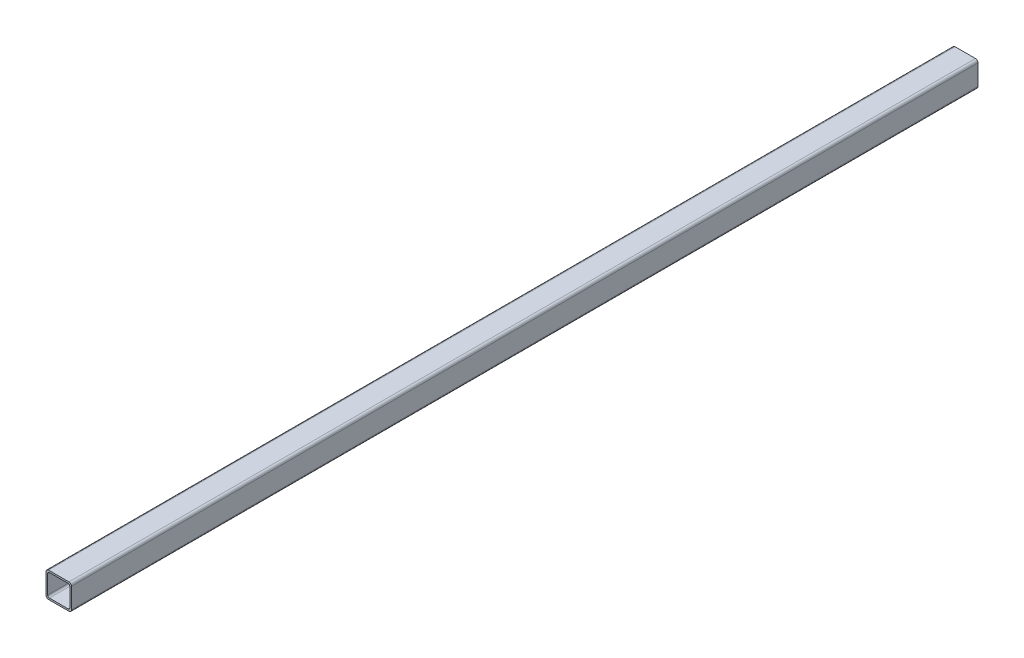
ISO-10303-21;
HEADER;
FILE_DESCRIPTION(('STEP AP214'),'2;1');
FILE_NAME('part.step','',(''),(''),'','','');
FILE_SCHEMA(('AUTOMOTIVE_DESIGN { 1 0 10303 214 1 1 1 1 }'));
ENDSEC;
DATA;
#1=APPLICATION_CONTEXT('core data for automotive mechanical design processes');
#2=APPLICATION_PROTOCOL_DEFINITION('international standard','automotive_design',2000,#1);
#3=PRODUCT_CONTEXT('',#1,'mechanical');
#4=PRODUCT('Part','Part','',(#3));
#5=PRODUCT_RELATED_PRODUCT_CATEGORY('part','',(#4));
#6=PRODUCT_DEFINITION_FORMATION('','',#4);
#7=PRODUCT_DEFINITION_CONTEXT('part definition',#1,'design');
#8=PRODUCT_DEFINITION('design','',#6,#7);
#9=PRODUCT_DEFINITION_SHAPE('','',#8);
#10=(LENGTH_UNIT() NAMED_UNIT(*) SI_UNIT(.MILLI.,.METRE.));
#11=(NAMED_UNIT(*) PLANE_ANGLE_UNIT() SI_UNIT($,.RADIAN.));
#12=(NAMED_UNIT(*) SI_UNIT($,.STERADIAN.) SOLID_ANGLE_UNIT());
#13=UNCERTAINTY_MEASURE_WITH_UNIT(LENGTH_MEASURE(1.E-05),#10,'distance_accuracy_value','');
#14=(GEOMETRIC_REPRESENTATION_CONTEXT(3) GLOBAL_UNCERTAINTY_ASSIGNED_CONTEXT((#13)) GLOBAL_UNIT_ASSIGNED_CONTEXT((#10,
#11,#12)) REPRESENTATION_CONTEXT('',''));
#15=CARTESIAN_POINT('',(0.,0.,0.));
#16=DIRECTION('',(0.,0.,1.));
#17=DIRECTION('',(1.,0.,0.));
#18=AXIS2_PLACEMENT_3D('',#15,#16,#17);
#19=CARTESIAN_POINT('',(12.,30.,-1036.42640687119));
#20=DIRECTION('',(0.,1.,0.));
#21=DIRECTION('',(-1.,0.,0.));
#22=AXIS2_PLACEMENT_3D('',#19,#20,#21);
#23=PLANE('',#22);
#24=DIRECTION('',(0.,0.,1.));
#25=VECTOR('',#24,1.);
#26=CARTESIAN_POINT('',(12.,30.,-1036.42640687119));
#27=LINE('',#26,#25);
#28=CARTESIAN_POINT('',(12.,29.9999999999997,-1078.));
#29=VERTEX_POINT('',#28);
#30=CARTESIAN_POINT('',(12.,30.,-10.));
#31=VERTEX_POINT('',#30);
#32=EDGE_CURVE('E40',#29,#31,#27,.T.);
#33=ORIENTED_EDGE('',*,*,#32,.F.);
#34=DIRECTION('',(-1.,0.,0.));
#35=VECTOR('',#34,1.);
#36=CARTESIAN_POINT('',(12.,29.9999999999997,-1078.));
#37=LINE('',#36,#35);
#38=CARTESIAN_POINT('',(-12.,29.9999999999997,-1078.));
#39=VERTEX_POINT('',#38);
#40=EDGE_CURVE('E192',#29,#39,#37,.T.);
#41=ORIENTED_EDGE('',*,*,#40,.T.);
#42=DIRECTION('',(0.,0.,1.));
#43=VECTOR('',#42,1.);
#44=CARTESIAN_POINT('',(-12.,30.,-1036.42640687119));
#45=LINE('',#44,#43);
#46=CARTESIAN_POINT('',(-12.,30.,-10.));
#47=VERTEX_POINT('',#46);
#48=EDGE_CURVE('E276',#39,#47,#45,.T.);
#49=ORIENTED_EDGE('',*,*,#48,.T.);
#50=DIRECTION('',(-1.,0.,0.));
#51=VECTOR('',#50,1.);
#52=CARTESIAN_POINT('',(12.,30.,-10.));
#53=LINE('',#52,#51);
#54=EDGE_CURVE('E247',#31,#47,#53,.T.);
#55=ORIENTED_EDGE('',*,*,#54,.F.);
#56=EDGE_LOOP('',(#33,#41,#49,#55));
#57=FACE_BOUND('',#56,.T.);
#58=ADVANCED_FACE('F36',(#57),#23,.T.);
#59=CARTESIAN_POINT('',(-12.,27.,-1036.42640687119));
#60=DIRECTION('',(0.,0.,1.));
#61=DIRECTION('',(1.,0.,0.));
#62=AXIS2_PLACEMENT_3D('',#59,#60,#61);
#63=CYLINDRICAL_SURFACE('',#62,3.);
#64=ORIENTED_EDGE('',*,*,#48,.F.);
#65=CARTESIAN_POINT('',(-12.,26.9999999999997,-1078.));
#66=DIRECTION('',(0.,0.,1.));
#67=DIRECTION('',(1.,0.,0.));
#68=AXIS2_PLACEMENT_3D('',#65,#66,#67);
#69=CIRCLE('',#68,3.);
#70=CARTESIAN_POINT('',(-15.,26.9999999999997,-1078.));
#71=VERTEX_POINT('',#70);
#72=EDGE_CURVE('E195',#39,#71,#69,.T.);
#73=ORIENTED_EDGE('',*,*,#72,.T.);
#74=DIRECTION('',(0.,0.,1.));
#75=VECTOR('',#74,1.);
#76=CARTESIAN_POINT('',(-15.,27.,-1036.42640687119));
#77=LINE('',#76,#75);
#78=CARTESIAN_POINT('',(-15.,27.,-10.));
#79=VERTEX_POINT('',#78);
#80=EDGE_CURVE('E275',#71,#79,#77,.T.);
#81=ORIENTED_EDGE('',*,*,#80,.T.);
#82=CARTESIAN_POINT('',(-12.,27.,-10.));
#83=DIRECTION('',(0.,0.,1.));
#84=DIRECTION('',(1.,0.,0.));
#85=AXIS2_PLACEMENT_3D('',#82,#83,#84);
#86=CIRCLE('',#85,3.);
#87=EDGE_CURVE('E250',#47,#79,#86,.T.);
#88=ORIENTED_EDGE('',*,*,#87,.F.);
#89=EDGE_LOOP('',(#64,#73,#81,#88));
#90=FACE_BOUND('',#89,.T.);
#91=ADVANCED_FACE('F305',(#90),#63,.T.);
#92=CARTESIAN_POINT('',(-15.,2.99999999999996,-1036.42640687119));
#93=DIRECTION('',(-1.,0.,0.));
#94=DIRECTION('',(0.,-1.,0.));
#95=AXIS2_PLACEMENT_3D('',#92,#93,#94);
#96=PLANE('',#95);
#97=ORIENTED_EDGE('',*,*,#80,.F.);
#98=DIRECTION('',(0.,-1.,0.));
#99=VECTOR('',#98,1.);
#100=CARTESIAN_POINT('',(-15.,2.99999999999972,-1078.));
#101=LINE('',#100,#99);
#102=CARTESIAN_POINT('',(-15.,2.99999999999972,-1078.));
#103=VERTEX_POINT('',#102);
#104=EDGE_CURVE('E198',#71,#103,#101,.T.);
#105=ORIENTED_EDGE('',*,*,#104,.T.);
#106=DIRECTION('',(0.,0.,1.));
#107=VECTOR('',#106,1.);
#108=CARTESIAN_POINT('',(-15.,2.99999999999996,-1036.42640687119));
#109=LINE('',#108,#107);
#110=CARTESIAN_POINT('',(-15.,2.99999999999996,-10.));
#111=VERTEX_POINT('',#110);
#112=EDGE_CURVE('E273',#103,#111,#109,.T.);
#113=ORIENTED_EDGE('',*,*,#112,.T.);
#114=DIRECTION('',(0.,-1.,0.));
#115=VECTOR('',#114,1.);
#116=CARTESIAN_POINT('',(-15.,2.99999999999996,-10.));
#117=LINE('',#116,#115);
#118=EDGE_CURVE('E253',#79,#111,#117,.T.);
#119=ORIENTED_EDGE('',*,*,#118,.F.);
#120=EDGE_LOOP('',(#97,#105,#113,#119));
#121=FACE_BOUND('',#120,.T.);
#122=ADVANCED_FACE('F302',(#121),#96,.T.);
#123=CARTESIAN_POINT('',(-12.,2.99999999999996,-1036.42640687119));
#124=DIRECTION('',(0.,0.,1.));
#125=DIRECTION('',(1.,0.,0.));
#126=AXIS2_PLACEMENT_3D('',#123,#124,#125);
#127=CYLINDRICAL_SURFACE('',#126,3.);
#128=ORIENTED_EDGE('',*,*,#112,.F.);
#129=CARTESIAN_POINT('',(-12.,2.99999999999972,-1078.));
#130=DIRECTION('',(0.,0.,1.));
#131=DIRECTION('',(-1.,0.,0.));
#132=AXIS2_PLACEMENT_3D('',#129,#130,#131);
#133=CIRCLE('',#132,3.);
#134=CARTESIAN_POINT('',(-12.,-2.80511724959354E-13,-1078.));
#135=VERTEX_POINT('',#134);
#136=EDGE_CURVE('E201',#103,#135,#133,.T.);
#137=ORIENTED_EDGE('',*,*,#136,.T.);
#138=DIRECTION('',(0.,0.,1.));
#139=VECTOR('',#138,1.);
#140=CARTESIAN_POINT('',(-12.,0.,-1036.42640687119));
#141=LINE('',#140,#139);
#142=CARTESIAN_POINT('',(-12.,0.,-10.));
#143=VERTEX_POINT('',#142);
#144=EDGE_CURVE('E271',#135,#143,#141,.T.);
#145=ORIENTED_EDGE('',*,*,#144,.T.);
#146=CARTESIAN_POINT('',(-12.,2.99999999999996,-10.));
#147=DIRECTION('',(0.,0.,1.));
#148=DIRECTION('',(-1.,0.,0.));
#149=AXIS2_PLACEMENT_3D('',#146,#147,#148);
#150=CIRCLE('',#149,3.);
#151=EDGE_CURVE('E256',#111,#143,#150,.T.);
#152=ORIENTED_EDGE('',*,*,#151,.F.);
#153=EDGE_LOOP('',(#128,#137,#145,#152));
#154=FACE_BOUND('',#153,.T.);
#155=ADVANCED_FACE('F298',(#154),#127,.T.);
#156=CARTESIAN_POINT('',(12.,0.,-1036.42640687119));
#157=DIRECTION('',(0.,-1.,0.));
#158=DIRECTION('',(1.,0.,0.));
#159=AXIS2_PLACEMENT_3D('',#156,#157,#158);
#160=PLANE('',#159);
#161=ORIENTED_EDGE('',*,*,#144,.F.);
#162=DIRECTION('',(1.,0.,0.));
#163=VECTOR('',#162,1.);
#164=CARTESIAN_POINT('',(12.,-2.770422780074E-13,-1078.));
#165=LINE('',#164,#163);
#166=CARTESIAN_POINT('',(12.,-2.770422780074E-13,-1078.));
#167=VERTEX_POINT('',#166);
#168=EDGE_CURVE('E204',#135,#167,#165,.T.);
#169=ORIENTED_EDGE('',*,*,#168,.T.);
#170=DIRECTION('',(0.,0.,1.));
#171=VECTOR('',#170,1.);
#172=CARTESIAN_POINT('',(12.,0.,-1036.42640687119));
#173=LINE('',#172,#171);
#174=CARTESIAN_POINT('',(12.,0.,-10.));
#175=VERTEX_POINT('',#174);
#176=EDGE_CURVE('E269',#167,#175,#173,.T.);
#177=ORIENTED_EDGE('',*,*,#176,.T.);
#178=DIRECTION('',(1.,0.,0.));
#179=VECTOR('',#178,1.);
#180=CARTESIAN_POINT('',(12.,0.,-10.));
#181=LINE('',#180,#179);
#182=EDGE_CURVE('E259',#143,#175,#181,.T.);
#183=ORIENTED_EDGE('',*,*,#182,.F.);
#184=EDGE_LOOP('',(#161,#169,#177,#183));
#185=FACE_BOUND('',#184,.T.);
#186=ADVANCED_FACE('F294',(#185),#160,.T.);
#187=CARTESIAN_POINT('',(12.,2.99999999999996,-1036.42640687119));
#188=DIRECTION('',(0.,0.,1.));
#189=DIRECTION('',(1.,0.,0.));
#190=AXIS2_PLACEMENT_3D('',#187,#188,#189);
#191=CYLINDRICAL_SURFACE('',#190,3.);
#192=ORIENTED_EDGE('',*,*,#176,.F.);
#193=CARTESIAN_POINT('',(12.,2.99999999999972,-1078.));
#194=DIRECTION('',(0.,0.,1.));
#195=DIRECTION('',(1.,0.,0.));
#196=AXIS2_PLACEMENT_3D('',#193,#194,#195);
#197=CIRCLE('',#196,3.);
#198=CARTESIAN_POINT('',(15.,2.99999999999974,-1078.));
#199=VERTEX_POINT('',#198);
#200=EDGE_CURVE('E207',#167,#199,#197,.T.);
#201=ORIENTED_EDGE('',*,*,#200,.T.);
#202=DIRECTION('',(0.,0.,1.));
#203=VECTOR('',#202,1.);
#204=CARTESIAN_POINT('',(15.,2.99999999999998,-1036.42640687119));
#205=LINE('',#204,#203);
#206=CARTESIAN_POINT('',(15.,2.99999999999998,-10.));
#207=VERTEX_POINT('',#206);
#208=EDGE_CURVE('E45',#199,#207,#205,.T.);
#209=ORIENTED_EDGE('',*,*,#208,.T.);
#210=CARTESIAN_POINT('',(12.,2.99999999999996,-10.));
#211=DIRECTION('',(0.,0.,1.));
#212=DIRECTION('',(1.,0.,0.));
#213=AXIS2_PLACEMENT_3D('',#210,#211,#212);
#214=CIRCLE('',#213,3.);
#215=EDGE_CURVE('E262',#175,#207,#214,.T.);
#216=ORIENTED_EDGE('',*,*,#215,.F.);
#217=EDGE_LOOP('',(#192,#201,#209,#216));
#218=FACE_BOUND('',#217,.T.);
#219=ADVANCED_FACE('F291',(#218),#191,.T.);
#220=CARTESIAN_POINT('',(15.,2.99999999999998,-1036.42640687119));
#221=DIRECTION('',(1.,0.,0.));
#222=DIRECTION('',(0.,1.,0.));
#223=AXIS2_PLACEMENT_3D('',#220,#221,#222);
#224=PLANE('',#223);
#225=ORIENTED_EDGE('',*,*,#208,.F.);
#226=DIRECTION('',(0.,1.,0.));
#227=VECTOR('',#226,1.);
#228=CARTESIAN_POINT('',(15.,2.99999999999974,-1078.));
#229=LINE('',#228,#227);
#230=CARTESIAN_POINT('',(15.,26.9999999999997,-1078.));
#231=VERTEX_POINT('',#230);
#232=EDGE_CURVE('E210',#199,#231,#229,.T.);
#233=ORIENTED_EDGE('',*,*,#232,.T.);
#234=DIRECTION('',(0.,0.,1.));
#235=VECTOR('',#234,1.);
#236=CARTESIAN_POINT('',(15.,27.,-1036.42640687119));
#237=LINE('',#236,#235);
#238=CARTESIAN_POINT('',(15.,27.,-10.));
#239=VERTEX_POINT('',#238);
#240=EDGE_CURVE('E11',#231,#239,#237,.T.);
#241=ORIENTED_EDGE('',*,*,#240,.T.);
#242=DIRECTION('',(0.,1.,0.));
#243=VECTOR('',#242,1.);
#244=CARTESIAN_POINT('',(15.,2.99999999999998,-10.));
#245=LINE('',#244,#243);
#246=EDGE_CURVE('E265',#207,#239,#245,.T.);
#247=ORIENTED_EDGE('',*,*,#246,.F.);
#248=EDGE_LOOP('',(#225,#233,#241,#247));
#249=FACE_BOUND('',#248,.T.);
#250=ADVANCED_FACE('F286',(#249),#224,.T.);
#251=CARTESIAN_POINT('',(12.,27.,-1036.42640687119));
#252=DIRECTION('',(0.,0.,1.));
#253=DIRECTION('',(1.,0.,0.));
#254=AXIS2_PLACEMENT_3D('',#251,#252,#253);
#255=CYLINDRICAL_SURFACE('',#254,3.);
#256=ORIENTED_EDGE('',*,*,#240,.F.);
#257=CARTESIAN_POINT('',(12.,26.9999999999997,-1078.));
#258=DIRECTION('',(0.,0.,1.));
#259=DIRECTION('',(1.,0.,0.));
#260=AXIS2_PLACEMENT_3D('',#257,#258,#259);
#261=CIRCLE('',#260,3.);
#262=EDGE_CURVE('E189',#231,#29,#261,.T.);
#263=ORIENTED_EDGE('',*,*,#262,.T.);
#264=ORIENTED_EDGE('',*,*,#32,.T.);
#265=CARTESIAN_POINT('',(12.,27.,-10.));
#266=DIRECTION('',(0.,0.,1.));
#267=DIRECTION('',(1.,0.,0.));
#268=AXIS2_PLACEMENT_3D('',#265,#266,#267);
#269=CIRCLE('',#268,3.);
#270=EDGE_CURVE('E234',#239,#31,#269,.T.);
#271=ORIENTED_EDGE('',*,*,#270,.F.);
#272=EDGE_LOOP('',(#256,#263,#264,#271));
#273=FACE_BOUND('',#272,.T.);
#274=ADVANCED_FACE('F38',(#273),#255,.T.);
#275=CARTESIAN_POINT('',(12.,27.,-10.));
#276=DIRECTION('',(0.,0.,1.));
#277=DIRECTION('',(1.,0.,0.));
#278=AXIS2_PLACEMENT_3D('',#275,#276,#277);
#279=PLANE('',#278);
#280=CARTESIAN_POINT('',(11.,26.,-10.));
#281=DIRECTION('',(0.,0.,1.));
#282=DIRECTION('',(1.,0.,0.));
#283=AXIS2_PLACEMENT_3D('',#280,#281,#282);
#284=CIRCLE('',#283,2.);
#285=CARTESIAN_POINT('',(13.,25.9999999999999,-10.));
#286=VERTEX_POINT('',#285);
#287=CARTESIAN_POINT('',(11.,28.,-10.));
#288=VERTEX_POINT('',#287);
#289=EDGE_CURVE('E212',#286,#288,#284,.T.);
#290=ORIENTED_EDGE('',*,*,#289,.F.);
#291=DIRECTION('',(0.,1.,0.));
#292=VECTOR('',#291,1.);
#293=CARTESIAN_POINT('',(13.,3.99999999999997,-10.));
#294=LINE('',#293,#292);
#295=CARTESIAN_POINT('',(13.,3.99999999999997,-10.));
#296=VERTEX_POINT('',#295);
#297=EDGE_CURVE('E229',#296,#286,#294,.T.);
#298=ORIENTED_EDGE('',*,*,#297,.F.);
#299=CARTESIAN_POINT('',(11.,3.99999999999996,-10.));
#300=DIRECTION('',(0.,0.,1.));
#301=DIRECTION('',(1.,0.,0.));
#302=AXIS2_PLACEMENT_3D('',#299,#300,#301);
#303=CIRCLE('',#302,2.);
#304=CARTESIAN_POINT('',(11.,1.99999999999996,-10.));
#305=VERTEX_POINT('',#304);
#306=EDGE_CURVE('E226',#305,#296,#303,.T.);
#307=ORIENTED_EDGE('',*,*,#306,.F.);
#308=DIRECTION('',(1.,0.,0.));
#309=VECTOR('',#308,1.);
#310=CARTESIAN_POINT('',(11.,1.99999999999996,-10.));
#311=LINE('',#310,#309);
#312=CARTESIAN_POINT('',(-11.,1.99999999999996,-10.));
#313=VERTEX_POINT('',#312);
#314=EDGE_CURVE('E223',#313,#305,#311,.T.);
#315=ORIENTED_EDGE('',*,*,#314,.F.);
#316=CARTESIAN_POINT('',(-11.,3.99999999999996,-10.));
#317=DIRECTION('',(0.,0.,1.));
#318=DIRECTION('',(-1.,0.,0.));
#319=AXIS2_PLACEMENT_3D('',#316,#317,#318);
#320=CIRCLE('',#319,2.);
#321=CARTESIAN_POINT('',(-13.,3.99999999999996,-10.));
#322=VERTEX_POINT('',#321);
#323=EDGE_CURVE('E220',#322,#313,#320,.T.);
#324=ORIENTED_EDGE('',*,*,#323,.F.);
#325=DIRECTION('',(0.,-1.,0.));
#326=VECTOR('',#325,1.);
#327=CARTESIAN_POINT('',(-13.,3.99999999999997,-10.));
#328=LINE('',#327,#326);
#329=CARTESIAN_POINT('',(-13.,25.9999999999999,-10.));
#330=VERTEX_POINT('',#329);
#331=EDGE_CURVE('E217',#330,#322,#328,.T.);
#332=ORIENTED_EDGE('',*,*,#331,.F.);
#333=CARTESIAN_POINT('',(-11.,26.,-10.));
#334=DIRECTION('',(0.,0.,1.));
#335=DIRECTION('',(1.,0.,0.));
#336=AXIS2_PLACEMENT_3D('',#333,#334,#335);
#337=CIRCLE('',#336,2.);
#338=CARTESIAN_POINT('',(-11.,28.,-10.));
#339=VERTEX_POINT('',#338);
#340=EDGE_CURVE('E215',#339,#330,#337,.T.);
#341=ORIENTED_EDGE('',*,*,#340,.F.);
#342=DIRECTION('',(-1.,0.,0.));
#343=VECTOR('',#342,1.);
#344=CARTESIAN_POINT('',(11.,28.,-10.));
#345=LINE('',#344,#343);
#346=EDGE_CURVE('E155',#288,#339,#345,.T.);
#347=ORIENTED_EDGE('',*,*,#346,.F.);
#348=EDGE_LOOP('',(#290,#298,#307,#315,#324,#332,#341,#347));
#349=FACE_BOUND('',#348,.T.);
#350=ORIENTED_EDGE('',*,*,#270,.T.);
#351=ORIENTED_EDGE('',*,*,#54,.T.);
#352=ORIENTED_EDGE('',*,*,#87,.T.);
#353=ORIENTED_EDGE('',*,*,#118,.T.);
#354=ORIENTED_EDGE('',*,*,#151,.T.);
#355=ORIENTED_EDGE('',*,*,#182,.T.);
#356=ORIENTED_EDGE('',*,*,#215,.T.);
#357=ORIENTED_EDGE('',*,*,#246,.T.);
#358=EDGE_LOOP('',(#350,#351,#352,#353,#354,#355,#356,#357));
#359=FACE_BOUND('',#358,.T.);
#360=ADVANCED_FACE('F284',(#349,#359),#279,.T.);
#361=CARTESIAN_POINT('',(11.,28.,-1036.42640687119));
#362=DIRECTION('',(0.,1.,0.));
#363=DIRECTION('',(-1.,0.,0.));
#364=AXIS2_PLACEMENT_3D('',#361,#362,#363);
#365=PLANE('',#364);
#366=DIRECTION('',(0.,0.,1.));
#367=VECTOR('',#366,1.);
#368=CARTESIAN_POINT('',(-11.,28.,-1036.42640687119));
#369=LINE('',#368,#367);
#370=CARTESIAN_POINT('',(-11.,27.9999999999997,-1078.));
#371=VERTEX_POINT('',#370);
#372=EDGE_CURVE('E148',#371,#339,#369,.T.);
#373=ORIENTED_EDGE('',*,*,#372,.F.);
#374=DIRECTION('',(-1.,0.,0.));
#375=VECTOR('',#374,1.);
#376=CARTESIAN_POINT('',(11.,27.9999999999997,-1078.));
#377=LINE('',#376,#375);
#378=CARTESIAN_POINT('',(11.,27.9999999999997,-1078.));
#379=VERTEX_POINT('',#378);
#380=EDGE_CURVE('E152',#379,#371,#377,.T.);
#381=ORIENTED_EDGE('',*,*,#380,.F.);
#382=DIRECTION('',(0.,0.,1.));
#383=VECTOR('',#382,1.);
#384=CARTESIAN_POINT('',(11.,28.,-1036.42640687119));
#385=LINE('',#384,#383);
#386=EDGE_CURVE('E53',#379,#288,#385,.T.);
#387=ORIENTED_EDGE('',*,*,#386,.T.);
#388=ORIENTED_EDGE('',*,*,#346,.T.);
#389=EDGE_LOOP('',(#373,#381,#387,#388));
#390=FACE_BOUND('',#389,.T.);
#391=ADVANCED_FACE('F150',(#390),#365,.F.);
#392=CARTESIAN_POINT('',(-11.,26.,-1036.42640687119));
#393=DIRECTION('',(0.,0.,1.));
#394=DIRECTION('',(1.,0.,0.));
#395=AXIS2_PLACEMENT_3D('',#392,#393,#394);
#396=CYLINDRICAL_SURFACE('',#395,2.);
#397=DIRECTION('',(0.,0.,1.));
#398=VECTOR('',#397,1.);
#399=CARTESIAN_POINT('',(-13.,25.9999999999999,-1036.42640687119));
#400=LINE('',#399,#398);
#401=CARTESIAN_POINT('',(-13.,25.9999999999997,-1078.));
#402=VERTEX_POINT('',#401);
#403=EDGE_CURVE('E159',#402,#330,#400,.T.);
#404=ORIENTED_EDGE('',*,*,#403,.F.);
#405=CARTESIAN_POINT('',(-11.,25.9999999999997,-1078.));
#406=DIRECTION('',(0.,0.,1.));
#407=DIRECTION('',(1.,0.,0.));
#408=AXIS2_PLACEMENT_3D('',#405,#406,#407);
#409=CIRCLE('',#408,2.);
#410=EDGE_CURVE('E162',#371,#402,#409,.T.);
#411=ORIENTED_EDGE('',*,*,#410,.F.);
#412=ORIENTED_EDGE('',*,*,#372,.T.);
#413=ORIENTED_EDGE('',*,*,#340,.T.);
#414=EDGE_LOOP('',(#404,#411,#412,#413));
#415=FACE_BOUND('',#414,.T.);
#416=ADVANCED_FACE('F163',(#415),#396,.F.);
#417=CARTESIAN_POINT('',(-13.,3.99999999999997,-1036.42640687119));
#418=DIRECTION('',(-1.,0.,0.));
#419=DIRECTION('',(0.,-1.,0.));
#420=AXIS2_PLACEMENT_3D('',#417,#418,#419);
#421=PLANE('',#420);
#422=DIRECTION('',(0.,0.,1.));
#423=VECTOR('',#422,1.);
#424=CARTESIAN_POINT('',(-13.,3.99999999999996,-1036.42640687119));
#425=LINE('',#424,#423);
#426=CARTESIAN_POINT('',(-13.,3.99999999999972,-1078.));
#427=VERTEX_POINT('',#426);
#428=EDGE_CURVE('E241',#427,#322,#425,.T.);
#429=ORIENTED_EDGE('',*,*,#428,.F.);
#430=DIRECTION('',(0.,-1.,0.));
#431=VECTOR('',#430,1.);
#432=CARTESIAN_POINT('',(-13.,3.99999999999973,-1078.));
#433=LINE('',#432,#431);
#434=EDGE_CURVE('E167',#402,#427,#433,.T.);
#435=ORIENTED_EDGE('',*,*,#434,.F.);
#436=ORIENTED_EDGE('',*,*,#403,.T.);
#437=ORIENTED_EDGE('',*,*,#331,.T.);
#438=EDGE_LOOP('',(#429,#435,#436,#437));
#439=FACE_BOUND('',#438,.T.);
#440=ADVANCED_FACE('F334',(#439),#421,.F.);
#441=CARTESIAN_POINT('',(-11.,3.99999999999996,-1036.42640687119));
#442=DIRECTION('',(0.,0.,1.));
#443=DIRECTION('',(1.,0.,0.));
#444=AXIS2_PLACEMENT_3D('',#441,#442,#443);
#445=CYLINDRICAL_SURFACE('',#444,2.);
#446=DIRECTION('',(0.,0.,1.));
#447=VECTOR('',#446,1.);
#448=CARTESIAN_POINT('',(-11.,1.99999999999996,-1036.42640687119));
#449=LINE('',#448,#447);
#450=CARTESIAN_POINT('',(-11.,1.99999999999972,-1078.));
#451=VERTEX_POINT('',#450);
#452=EDGE_CURVE('E239',#451,#313,#449,.T.);
#453=ORIENTED_EDGE('',*,*,#452,.F.);
#454=CARTESIAN_POINT('',(-11.,3.99999999999972,-1078.));
#455=DIRECTION('',(0.,0.,1.));
#456=DIRECTION('',(-1.,0.,0.));
#457=AXIS2_PLACEMENT_3D('',#454,#455,#456);
#458=CIRCLE('',#457,2.);
#459=EDGE_CURVE('E178',#427,#451,#458,.T.);
#460=ORIENTED_EDGE('',*,*,#459,.F.);
#461=ORIENTED_EDGE('',*,*,#428,.T.);
#462=ORIENTED_EDGE('',*,*,#323,.T.);
#463=EDGE_LOOP('',(#453,#460,#461,#462));
#464=FACE_BOUND('',#463,.T.);
#465=ADVANCED_FACE('F337',(#464),#445,.F.);
#466=CARTESIAN_POINT('',(11.,1.99999999999996,-1036.42640687119));
#467=DIRECTION('',(0.,-1.,0.));
#468=DIRECTION('',(1.,0.,0.));
#469=AXIS2_PLACEMENT_3D('',#466,#467,#468);
#470=PLANE('',#469);
#471=DIRECTION('',(0.,0.,1.));
#472=VECTOR('',#471,1.);
#473=CARTESIAN_POINT('',(11.,1.99999999999996,-1036.42640687119));
#474=LINE('',#473,#472);
#475=CARTESIAN_POINT('',(11.,1.99999999999972,-1078.));
#476=VERTEX_POINT('',#475);
#477=EDGE_CURVE('E237',#476,#305,#474,.T.);
#478=ORIENTED_EDGE('',*,*,#477,.F.);
#479=DIRECTION('',(1.,0.,0.));
#480=VECTOR('',#479,1.);
#481=CARTESIAN_POINT('',(11.,1.99999999999972,-1078.));
#482=LINE('',#481,#480);
#483=EDGE_CURVE('E181',#451,#476,#482,.T.);
#484=ORIENTED_EDGE('',*,*,#483,.F.);
#485=ORIENTED_EDGE('',*,*,#452,.T.);
#486=ORIENTED_EDGE('',*,*,#314,.T.);
#487=EDGE_LOOP('',(#478,#484,#485,#486));
#488=FACE_BOUND('',#487,.T.);
#489=ADVANCED_FACE('F341',(#488),#470,.F.);
#490=CARTESIAN_POINT('',(11.,3.99999999999996,-1036.42640687119));
#491=DIRECTION('',(0.,0.,1.));
#492=DIRECTION('',(1.,0.,0.));
#493=AXIS2_PLACEMENT_3D('',#490,#491,#492);
#494=CYLINDRICAL_SURFACE('',#493,2.);
#495=DIRECTION('',(0.,0.,1.));
#496=VECTOR('',#495,1.);
#497=CARTESIAN_POINT('',(13.,3.99999999999997,-1036.42640687119));
#498=LINE('',#497,#496);
#499=CARTESIAN_POINT('',(13.,3.99999999999974,-1078.));
#500=VERTEX_POINT('',#499);
#501=EDGE_CURVE('E235',#500,#296,#498,.T.);
#502=ORIENTED_EDGE('',*,*,#501,.F.);
#503=CARTESIAN_POINT('',(11.,3.99999999999972,-1078.));
#504=DIRECTION('',(0.,0.,1.));
#505=DIRECTION('',(1.,0.,0.));
#506=AXIS2_PLACEMENT_3D('',#503,#504,#505);
#507=CIRCLE('',#506,2.);
#508=EDGE_CURVE('E184',#476,#500,#507,.T.);
#509=ORIENTED_EDGE('',*,*,#508,.F.);
#510=ORIENTED_EDGE('',*,*,#477,.T.);
#511=ORIENTED_EDGE('',*,*,#306,.T.);
#512=EDGE_LOOP('',(#502,#509,#510,#511));
#513=FACE_BOUND('',#512,.T.);
#514=ADVANCED_FACE('F345',(#513),#494,.F.);
#515=CARTESIAN_POINT('',(13.,3.99999999999997,-1036.42640687119));
#516=DIRECTION('',(1.,0.,0.));
#517=DIRECTION('',(0.,1.,0.));
#518=AXIS2_PLACEMENT_3D('',#515,#516,#517);
#519=PLANE('',#518);
#520=DIRECTION('',(0.,0.,1.));
#521=VECTOR('',#520,1.);
#522=CARTESIAN_POINT('',(13.,25.9999999999999,-1036.42640687119));
#523=LINE('',#522,#521);
#524=CARTESIAN_POINT('',(13.,25.9999999999997,-1078.));
#525=VERTEX_POINT('',#524);
#526=EDGE_CURVE('E232',#525,#286,#523,.T.);
#527=ORIENTED_EDGE('',*,*,#526,.F.);
#528=DIRECTION('',(0.,1.,0.));
#529=VECTOR('',#528,1.);
#530=CARTESIAN_POINT('',(13.,3.99999999999974,-1078.));
#531=LINE('',#530,#529);
#532=EDGE_CURVE('E187',#500,#525,#531,.T.);
#533=ORIENTED_EDGE('',*,*,#532,.F.);
#534=ORIENTED_EDGE('',*,*,#501,.T.);
#535=ORIENTED_EDGE('',*,*,#297,.T.);
#536=EDGE_LOOP('',(#527,#533,#534,#535));
#537=FACE_BOUND('',#536,.T.);
#538=ADVANCED_FACE('F328',(#537),#519,.F.);
#539=CARTESIAN_POINT('',(11.,26.,-1036.42640687119));
#540=DIRECTION('',(0.,0.,1.));
#541=DIRECTION('',(1.,0.,0.));
#542=AXIS2_PLACEMENT_3D('',#539,#540,#541);
#543=CYLINDRICAL_SURFACE('',#542,2.);
#544=ORIENTED_EDGE('',*,*,#386,.F.);
#545=CARTESIAN_POINT('',(11.,25.9999999999997,-1078.));
#546=DIRECTION('',(0.,0.,1.));
#547=DIRECTION('',(1.,0.,0.));
#548=AXIS2_PLACEMENT_3D('',#545,#546,#547);
#549=CIRCLE('',#548,2.);
#550=EDGE_CURVE('E173',#525,#379,#549,.T.);
#551=ORIENTED_EDGE('',*,*,#550,.F.);
#552=ORIENTED_EDGE('',*,*,#526,.T.);
#553=ORIENTED_EDGE('',*,*,#289,.T.);
#554=EDGE_LOOP('',(#544,#551,#552,#553));
#555=FACE_BOUND('',#554,.T.);
#556=ADVANCED_FACE('F325',(#555),#543,.F.);
#557=CARTESIAN_POINT('',(12.,26.9999999999997,-1078.));
#558=DIRECTION('',(0.,0.,-1.));
#559=DIRECTION('',(1.,0.,0.));
#560=AXIS2_PLACEMENT_3D('',#557,#558,#559);
#561=PLANE('',#560);
#562=ORIENTED_EDGE('',*,*,#550,.T.);
#563=ORIENTED_EDGE('',*,*,#380,.T.);
#564=ORIENTED_EDGE('',*,*,#410,.T.);
#565=ORIENTED_EDGE('',*,*,#434,.T.);
#566=ORIENTED_EDGE('',*,*,#459,.T.);
#567=ORIENTED_EDGE('',*,*,#483,.T.);
#568=ORIENTED_EDGE('',*,*,#508,.T.);
#569=ORIENTED_EDGE('',*,*,#532,.T.);
#570=EDGE_LOOP('',(#562,#563,#564,#565,#566,#567,#568,#569));
#571=FACE_BOUND('',#570,.T.);
#572=ORIENTED_EDGE('',*,*,#262,.F.);
#573=ORIENTED_EDGE('',*,*,#232,.F.);
#574=ORIENTED_EDGE('',*,*,#200,.F.);
#575=ORIENTED_EDGE('',*,*,#168,.F.);
#576=ORIENTED_EDGE('',*,*,#136,.F.);
#577=ORIENTED_EDGE('',*,*,#104,.F.);
#578=ORIENTED_EDGE('',*,*,#72,.F.);
#579=ORIENTED_EDGE('',*,*,#40,.F.);
#580=EDGE_LOOP('',(#572,#573,#574,#575,#576,#577,#578,#579));
#581=FACE_BOUND('',#580,.T.);
#582=ADVANCED_FACE('F169',(#571,#581),#561,.T.);
#583=CLOSED_SHELL('',(#58,#91,#122,#155,#186,#219,#250,#274,#360,#391,#416,#440,#465,#489,#514,
#538,#556,#582));
#584=MANIFOLD_SOLID_BREP('B2',#583);
#585=ADVANCED_BREP_SHAPE_REPRESENTATION('',(#18,#584),#14);
#586=SHAPE_DEFINITION_REPRESENTATION(#9,#585);
ENDSEC;
END-ISO-10303-21;
